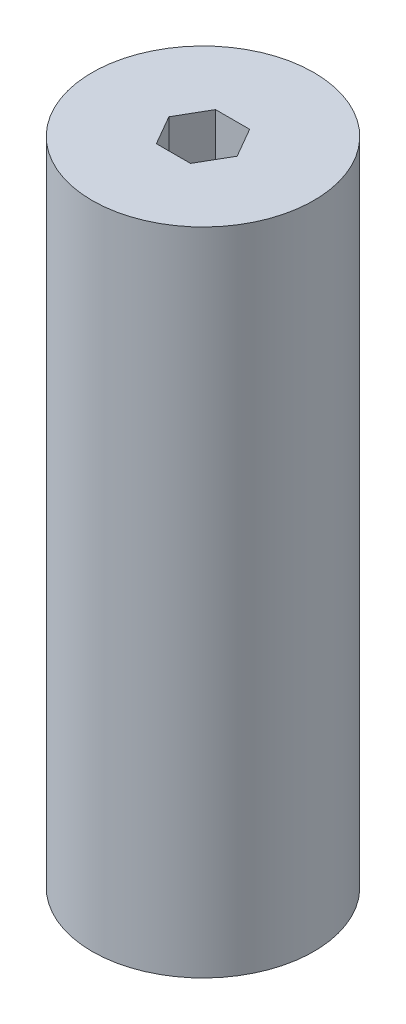
ISO-10303-21;
HEADER;
FILE_DESCRIPTION(('STEP AP214'),'2;1');
FILE_NAME('part.step','',(''),(''),'','','');
FILE_SCHEMA(('AUTOMOTIVE_DESIGN { 1 0 10303 214 1 1 1 1 }'));
ENDSEC;
DATA;
#1=APPLICATION_CONTEXT('core data for automotive mechanical design processes');
#2=APPLICATION_PROTOCOL_DEFINITION('international standard','automotive_design',2000,#1);
#3=PRODUCT_CONTEXT('',#1,'mechanical');
#4=PRODUCT('Part','Part','',(#3));
#5=PRODUCT_RELATED_PRODUCT_CATEGORY('part','',(#4));
#6=PRODUCT_DEFINITION_FORMATION('','',#4);
#7=PRODUCT_DEFINITION_CONTEXT('part definition',#1,'design');
#8=PRODUCT_DEFINITION('design','',#6,#7);
#9=PRODUCT_DEFINITION_SHAPE('','',#8);
#10=(LENGTH_UNIT() NAMED_UNIT(*) SI_UNIT(.MILLI.,.METRE.));
#11=(NAMED_UNIT(*) PLANE_ANGLE_UNIT() SI_UNIT($,.RADIAN.));
#12=(NAMED_UNIT(*) SI_UNIT($,.STERADIAN.) SOLID_ANGLE_UNIT());
#13=UNCERTAINTY_MEASURE_WITH_UNIT(LENGTH_MEASURE(1.E-05),#10,'distance_accuracy_value','');
#14=(GEOMETRIC_REPRESENTATION_CONTEXT(3) GLOBAL_UNCERTAINTY_ASSIGNED_CONTEXT((#13)) GLOBAL_UNIT_ASSIGNED_CONTEXT((#10,
#11,#12)) REPRESENTATION_CONTEXT('',''));
#15=CARTESIAN_POINT('',(0.,0.,0.));
#16=DIRECTION('',(0.,0.,1.));
#17=DIRECTION('',(1.,0.,0.));
#18=AXIS2_PLACEMENT_3D('',#15,#16,#17);
#19=CARTESIAN_POINT('',(0.,139.7,0.));
#20=DIRECTION('',(0.,1.,0.));
#21=DIRECTION('',(0.,0.,1.));
#22=AXIS2_PLACEMENT_3D('',#19,#20,#21);
#23=PLANE('',#22);
#24=CARTESIAN_POINT('',(0.,139.7,0.));
#25=DIRECTION('',(0.,1.,0.));
#26=DIRECTION('',(0.,0.,1.));
#27=AXIS2_PLACEMENT_3D('',#24,#25,#26);
#28=CIRCLE('',#27,23.8125);
#29=CARTESIAN_POINT('',(0.,139.7,23.8125));
#30=VERTEX_POINT('',#29);
#31=EDGE_CURVE('E11',#30,#30,#28,.T.);
#32=ORIENTED_EDGE('',*,*,#31,.T.);
#33=EDGE_LOOP('',(#32));
#34=FACE_BOUND('',#33,.T.);
#35=DIRECTION('',(0.5,0.,-0.866025403784439));
#36=VECTOR('',#35,1.);
#37=CARTESIAN_POINT('',(3.66617420935412,139.7,6.35));
#38=LINE('',#37,#36);
#39=CARTESIAN_POINT('',(3.66617420935412,139.7,6.35));
#40=VERTEX_POINT('',#39);
#41=CARTESIAN_POINT('',(7.33234841870825,139.7,0.));
#42=VERTEX_POINT('',#41);
#43=EDGE_CURVE('E96',#40,#42,#38,.T.);
#44=ORIENTED_EDGE('',*,*,#43,.F.);
#45=DIRECTION('',(1.,0.,0.));
#46=VECTOR('',#45,1.);
#47=CARTESIAN_POINT('',(-3.66617420935413,139.7,6.35));
#48=LINE('',#47,#46);
#49=CARTESIAN_POINT('',(-3.66617420935413,139.7,6.35));
#50=VERTEX_POINT('',#49);
#51=EDGE_CURVE('E88',#50,#40,#48,.T.);
#52=ORIENTED_EDGE('',*,*,#51,.F.);
#53=DIRECTION('',(0.5,0.,0.866025403784439));
#54=VECTOR('',#53,1.);
#55=CARTESIAN_POINT('',(-7.33234841870825,139.7,0.));
#56=LINE('',#55,#54);
#57=CARTESIAN_POINT('',(-7.33234841870825,139.7,0.));
#58=VERTEX_POINT('',#57);
#59=EDGE_CURVE('E116',#58,#50,#56,.T.);
#60=ORIENTED_EDGE('',*,*,#59,.F.);
#61=DIRECTION('',(-0.5,0.,0.866025403784439));
#62=VECTOR('',#61,1.);
#63=CARTESIAN_POINT('',(-3.66617420935412,139.7,-6.35));
#64=LINE('',#63,#62);
#65=CARTESIAN_POINT('',(-3.66617420935412,139.7,-6.35));
#66=VERTEX_POINT('',#65);
#67=EDGE_CURVE('E114',#66,#58,#64,.T.);
#68=ORIENTED_EDGE('',*,*,#67,.F.);
#69=DIRECTION('',(-1.,0.,0.));
#70=VECTOR('',#69,1.);
#71=CARTESIAN_POINT('',(3.66617420935413,139.7,-6.35));
#72=LINE('',#71,#70);
#73=CARTESIAN_POINT('',(3.66617420935413,139.7,-6.35));
#74=VERTEX_POINT('',#73);
#75=EDGE_CURVE('E110',#74,#66,#72,.T.);
#76=ORIENTED_EDGE('',*,*,#75,.F.);
#77=DIRECTION('',(-0.5,0.,-0.866025403784439));
#78=VECTOR('',#77,1.);
#79=CARTESIAN_POINT('',(7.33234841870825,139.7,0.));
#80=LINE('',#79,#78);
#81=EDGE_CURVE('E108',#42,#74,#80,.T.);
#82=ORIENTED_EDGE('',*,*,#81,.F.);
#83=EDGE_LOOP('',(#44,#52,#60,#68,#76,#82));
#84=FACE_BOUND('',#83,.T.);
#85=ADVANCED_FACE('F35',(#34,#84),#23,.T.);
#86=CARTESIAN_POINT('',(0.,0.,0.));
#87=DIRECTION('',(0.,1.,0.));
#88=DIRECTION('',(0.,0.,1.));
#89=AXIS2_PLACEMENT_3D('',#86,#87,#88);
#90=PLANE('',#89);
#91=CARTESIAN_POINT('',(0.,0.,0.));
#92=DIRECTION('',(0.,1.,0.));
#93=DIRECTION('',(0.,0.,1.));
#94=AXIS2_PLACEMENT_3D('',#91,#92,#93);
#95=CIRCLE('',#94,23.8125);
#96=CARTESIAN_POINT('',(0.,0.,23.8125));
#97=VERTEX_POINT('',#96);
#98=EDGE_CURVE('E39',#97,#97,#95,.T.);
#99=ORIENTED_EDGE('',*,*,#98,.F.);
#100=EDGE_LOOP('',(#99));
#101=FACE_BOUND('',#100,.T.);
#102=DIRECTION('',(1.,0.,0.));
#103=VECTOR('',#102,1.);
#104=CARTESIAN_POINT('',(-3.66617420935413,0.,6.35));
#105=LINE('',#104,#103);
#106=CARTESIAN_POINT('',(-3.66617420935413,0.,6.35));
#107=VERTEX_POINT('',#106);
#108=CARTESIAN_POINT('',(3.66617420935412,0.,6.35));
#109=VERTEX_POINT('',#108);
#110=EDGE_CURVE('E58',#107,#109,#105,.T.);
#111=ORIENTED_EDGE('',*,*,#110,.T.);
#112=DIRECTION('',(0.5,0.,-0.866025403784439));
#113=VECTOR('',#112,1.);
#114=CARTESIAN_POINT('',(3.66617420935412,0.,6.35));
#115=LINE('',#114,#113);
#116=CARTESIAN_POINT('',(7.33234841870825,0.,0.));
#117=VERTEX_POINT('',#116);
#118=EDGE_CURVE('E103',#109,#117,#115,.T.);
#119=ORIENTED_EDGE('',*,*,#118,.T.);
#120=DIRECTION('',(-0.5,0.,-0.866025403784439));
#121=VECTOR('',#120,1.);
#122=CARTESIAN_POINT('',(7.33234841870825,0.,0.));
#123=LINE('',#122,#121);
#124=CARTESIAN_POINT('',(3.66617420935413,0.,-6.35));
#125=VERTEX_POINT('',#124);
#126=EDGE_CURVE('E120',#117,#125,#123,.T.);
#127=ORIENTED_EDGE('',*,*,#126,.T.);
#128=DIRECTION('',(-1.,0.,0.));
#129=VECTOR('',#128,1.);
#130=CARTESIAN_POINT('',(3.66617420935413,0.,-6.35));
#131=LINE('',#130,#129);
#132=CARTESIAN_POINT('',(-3.66617420935412,0.,-6.35));
#133=VERTEX_POINT('',#132);
#134=EDGE_CURVE('E123',#125,#133,#131,.T.);
#135=ORIENTED_EDGE('',*,*,#134,.T.);
#136=DIRECTION('',(-0.5,0.,0.866025403784439));
#137=VECTOR('',#136,1.);
#138=CARTESIAN_POINT('',(-3.66617420935412,0.,-6.35));
#139=LINE('',#138,#137);
#140=CARTESIAN_POINT('',(-7.33234841870825,0.,0.));
#141=VERTEX_POINT('',#140);
#142=EDGE_CURVE('E126',#133,#141,#139,.T.);
#143=ORIENTED_EDGE('',*,*,#142,.T.);
#144=DIRECTION('',(0.5,0.,0.866025403784439));
#145=VECTOR('',#144,1.);
#146=CARTESIAN_POINT('',(-7.33234841870825,0.,0.));
#147=LINE('',#146,#145);
#148=EDGE_CURVE('E97',#141,#107,#147,.T.);
#149=ORIENTED_EDGE('',*,*,#148,.T.);
#150=EDGE_LOOP('',(#111,#119,#127,#135,#143,#149));
#151=FACE_BOUND('',#150,.T.);
#152=ADVANCED_FACE('F143',(#101,#151),#90,.F.);
#153=CARTESIAN_POINT('',(0.,139.7,0.));
#154=DIRECTION('',(0.,-1.,0.));
#155=DIRECTION('',(0.,0.,-1.));
#156=AXIS2_PLACEMENT_3D('',#153,#154,#155);
#157=CYLINDRICAL_SURFACE('',#156,23.8125);
#158=ORIENTED_EDGE('',*,*,#31,.F.);
#159=EDGE_LOOP('',(#158));
#160=FACE_BOUND('',#159,.T.);
#161=ORIENTED_EDGE('',*,*,#98,.T.);
#162=EDGE_LOOP('',(#161));
#163=FACE_BOUND('',#162,.T.);
#164=ADVANCED_FACE('F37',(#160,#163),#157,.T.);
#165=CARTESIAN_POINT('',(-3.66617420935413,139.7,6.35));
#166=DIRECTION('',(0.,0.,-1.));
#167=DIRECTION('',(-1.,0.,0.));
#168=AXIS2_PLACEMENT_3D('',#165,#166,#167);
#169=PLANE('',#168);
#170=ORIENTED_EDGE('',*,*,#110,.F.);
#171=DIRECTION('',(0.,-1.,0.));
#172=VECTOR('',#171,1.);
#173=CARTESIAN_POINT('',(-3.66617420935413,139.7,6.35));
#174=LINE('',#173,#172);
#175=EDGE_CURVE('E92',#50,#107,#174,.T.);
#176=ORIENTED_EDGE('',*,*,#175,.F.);
#177=ORIENTED_EDGE('',*,*,#51,.T.);
#178=DIRECTION('',(0.,-1.,0.));
#179=VECTOR('',#178,1.);
#180=CARTESIAN_POINT('',(3.66617420935412,139.7,6.35));
#181=LINE('',#180,#179);
#182=EDGE_CURVE('E91',#40,#109,#181,.T.);
#183=ORIENTED_EDGE('',*,*,#182,.T.);
#184=EDGE_LOOP('',(#170,#176,#177,#183));
#185=FACE_BOUND('',#184,.T.);
#186=ADVANCED_FACE('F90',(#185),#169,.T.);
#187=CARTESIAN_POINT('',(3.66617420935412,139.7,6.35));
#188=DIRECTION('',(-0.866025403784439,0.,-0.5));
#189=DIRECTION('',(-0.5,0.,0.866025403784438));
#190=AXIS2_PLACEMENT_3D('',#187,#188,#189);
#191=PLANE('',#190);
#192=ORIENTED_EDGE('',*,*,#118,.F.);
#193=ORIENTED_EDGE('',*,*,#182,.F.);
#194=ORIENTED_EDGE('',*,*,#43,.T.);
#195=DIRECTION('',(0.,-1.,0.));
#196=VECTOR('',#195,1.);
#197=CARTESIAN_POINT('',(7.33234841870825,139.7,0.));
#198=LINE('',#197,#196);
#199=EDGE_CURVE('E104',#42,#117,#198,.T.);
#200=ORIENTED_EDGE('',*,*,#199,.T.);
#201=EDGE_LOOP('',(#192,#193,#194,#200));
#202=FACE_BOUND('',#201,.T.);
#203=ADVANCED_FACE('F100',(#202),#191,.T.);
#204=CARTESIAN_POINT('',(7.33234841870825,139.7,0.));
#205=DIRECTION('',(-0.866025403784439,0.,0.5));
#206=DIRECTION('',(0.5,0.,0.866025403784439));
#207=AXIS2_PLACEMENT_3D('',#204,#205,#206);
#208=PLANE('',#207);
#209=ORIENTED_EDGE('',*,*,#126,.F.);
#210=ORIENTED_EDGE('',*,*,#199,.F.);
#211=ORIENTED_EDGE('',*,*,#81,.T.);
#212=DIRECTION('',(0.,-1.,0.));
#213=VECTOR('',#212,1.);
#214=CARTESIAN_POINT('',(3.66617420935413,139.7,-6.35));
#215=LINE('',#214,#213);
#216=EDGE_CURVE('E135',#74,#125,#215,.T.);
#217=ORIENTED_EDGE('',*,*,#216,.T.);
#218=EDGE_LOOP('',(#209,#210,#211,#217));
#219=FACE_BOUND('',#218,.T.);
#220=ADVANCED_FACE('F139',(#219),#208,.T.);
#221=CARTESIAN_POINT('',(3.66617420935413,139.7,-6.35));
#222=DIRECTION('',(0.,0.,1.));
#223=DIRECTION('',(1.,0.,0.));
#224=AXIS2_PLACEMENT_3D('',#221,#222,#223);
#225=PLANE('',#224);
#226=ORIENTED_EDGE('',*,*,#134,.F.);
#227=ORIENTED_EDGE('',*,*,#216,.F.);
#228=ORIENTED_EDGE('',*,*,#75,.T.);
#229=DIRECTION('',(0.,-1.,0.));
#230=VECTOR('',#229,1.);
#231=CARTESIAN_POINT('',(-3.66617420935412,139.7,-6.35));
#232=LINE('',#231,#230);
#233=EDGE_CURVE('E133',#66,#133,#232,.T.);
#234=ORIENTED_EDGE('',*,*,#233,.T.);
#235=EDGE_LOOP('',(#226,#227,#228,#234));
#236=FACE_BOUND('',#235,.T.);
#237=ADVANCED_FACE('F151',(#236),#225,.T.);
#238=CARTESIAN_POINT('',(-3.66617420935412,139.7,-6.35));
#239=DIRECTION('',(0.866025403784439,0.,0.5));
#240=DIRECTION('',(0.5,0.,-0.866025403784438));
#241=AXIS2_PLACEMENT_3D('',#238,#239,#240);
#242=PLANE('',#241);
#243=ORIENTED_EDGE('',*,*,#142,.F.);
#244=ORIENTED_EDGE('',*,*,#233,.F.);
#245=ORIENTED_EDGE('',*,*,#67,.T.);
#246=DIRECTION('',(0.,-1.,0.));
#247=VECTOR('',#246,1.);
#248=CARTESIAN_POINT('',(-7.33234841870825,139.7,0.));
#249=LINE('',#248,#247);
#250=EDGE_CURVE('E50',#58,#141,#249,.T.);
#251=ORIENTED_EDGE('',*,*,#250,.T.);
#252=EDGE_LOOP('',(#243,#244,#245,#251));
#253=FACE_BOUND('',#252,.T.);
#254=ADVANCED_FACE('F149',(#253),#242,.T.);
#255=CARTESIAN_POINT('',(-7.33234841870825,139.7,0.));
#256=DIRECTION('',(0.866025403784439,0.,-0.5));
#257=DIRECTION('',(-0.5,0.,-0.866025403784439));
#258=AXIS2_PLACEMENT_3D('',#255,#256,#257);
#259=PLANE('',#258);
#260=ORIENTED_EDGE('',*,*,#148,.F.);
#261=ORIENTED_EDGE('',*,*,#250,.F.);
#262=ORIENTED_EDGE('',*,*,#59,.T.);
#263=ORIENTED_EDGE('',*,*,#175,.T.);
#264=EDGE_LOOP('',(#260,#261,#262,#263));
#265=FACE_BOUND('',#264,.T.);
#266=ADVANCED_FACE('F145',(#265),#259,.T.);
#267=CLOSED_SHELL('',(#85,#152,#164,#186,#203,#220,#237,#254,#266));
#268=MANIFOLD_SOLID_BREP('B2',#267);
#269=ADVANCED_BREP_SHAPE_REPRESENTATION('',(#18,#268),#14);
#270=SHAPE_DEFINITION_REPRESENTATION(#9,#269);
ENDSEC;
END-ISO-10303-21;
